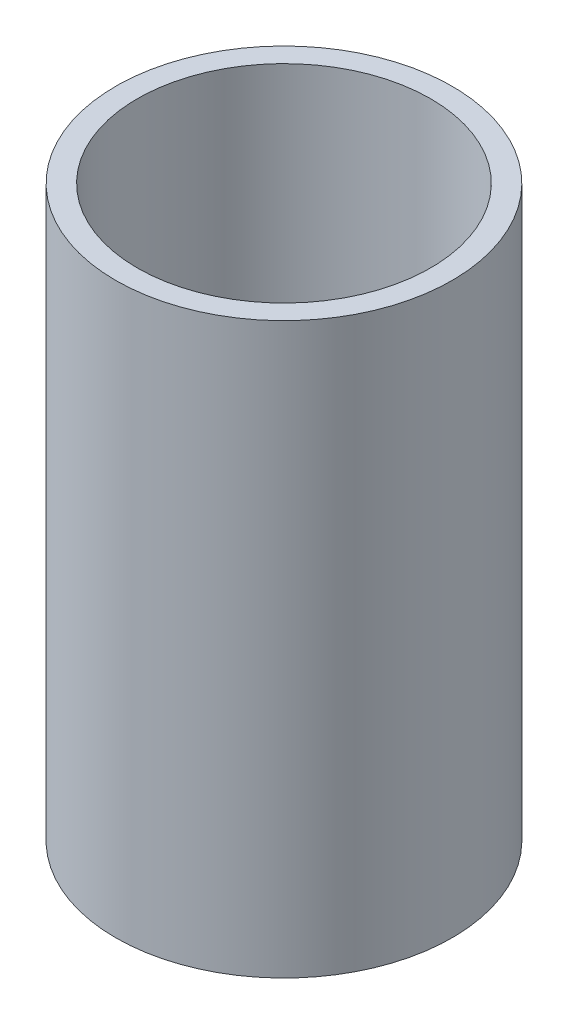
ISO-10303-21;
HEADER;
FILE_DESCRIPTION(('STEP AP214'),'2;1');
FILE_NAME('part.step','',(''),(''),'','','');
FILE_SCHEMA(('AUTOMOTIVE_DESIGN { 1 0 10303 214 1 1 1 1 }'));
ENDSEC;
DATA;
#1=APPLICATION_CONTEXT('core data for automotive mechanical design processes');
#2=APPLICATION_PROTOCOL_DEFINITION('international standard','automotive_design',2000,#1);
#3=PRODUCT_CONTEXT('',#1,'mechanical');
#4=PRODUCT('Part','Part','',(#3));
#5=PRODUCT_RELATED_PRODUCT_CATEGORY('part','',(#4));
#6=PRODUCT_DEFINITION_FORMATION('','',#4);
#7=PRODUCT_DEFINITION_CONTEXT('part definition',#1,'design');
#8=PRODUCT_DEFINITION('design','',#6,#7);
#9=PRODUCT_DEFINITION_SHAPE('','',#8);
#10=(LENGTH_UNIT() NAMED_UNIT(*) SI_UNIT(.MILLI.,.METRE.));
#11=(NAMED_UNIT(*) PLANE_ANGLE_UNIT() SI_UNIT($,.RADIAN.));
#12=(NAMED_UNIT(*) SI_UNIT($,.STERADIAN.) SOLID_ANGLE_UNIT());
#13=UNCERTAINTY_MEASURE_WITH_UNIT(LENGTH_MEASURE(1.E-05),#10,'distance_accuracy_value','');
#14=(GEOMETRIC_REPRESENTATION_CONTEXT(3) GLOBAL_UNCERTAINTY_ASSIGNED_CONTEXT((#13)) GLOBAL_UNIT_ASSIGNED_CONTEXT((#10,
#11,#12)) REPRESENTATION_CONTEXT('',''));
#15=CARTESIAN_POINT('',(0.,0.,0.));
#16=DIRECTION('',(0.,0.,1.));
#17=DIRECTION('',(1.,0.,0.));
#18=AXIS2_PLACEMENT_3D('',#15,#16,#17);
#19=CARTESIAN_POINT('',(0.,33.,0.));
#20=DIRECTION('',(0.,1.,0.));
#21=DIRECTION('',(0.,0.,1.));
#22=AXIS2_PLACEMENT_3D('',#19,#20,#21);
#23=PLANE('',#22);
#24=CARTESIAN_POINT('',(0.,33.,0.));
#25=DIRECTION('',(0.,1.,0.));
#26=DIRECTION('',(0.,0.,1.));
#27=AXIS2_PLACEMENT_3D('',#24,#25,#26);
#28=CIRCLE('',#27,9.75);
#29=CARTESIAN_POINT('',(0.,33.,9.75));
#30=VERTEX_POINT('',#29);
#31=EDGE_CURVE('E44',#30,#30,#28,.T.);
#32=ORIENTED_EDGE('',*,*,#31,.T.);
#33=EDGE_LOOP('',(#32));
#34=FACE_BOUND('',#33,.T.);
#35=CARTESIAN_POINT('',(0.,33.,0.));
#36=DIRECTION('',(0.,1.,0.));
#37=DIRECTION('',(0.,0.,1.));
#38=AXIS2_PLACEMENT_3D('',#35,#36,#37);
#39=CIRCLE('',#38,8.5);
#40=CARTESIAN_POINT('',(0.,33.,8.5));
#41=VERTEX_POINT('',#40);
#42=EDGE_CURVE('E53',#41,#41,#39,.T.);
#43=ORIENTED_EDGE('',*,*,#42,.F.);
#44=EDGE_LOOP('',(#43));
#45=FACE_BOUND('',#44,.T.);
#46=ADVANCED_FACE('F37',(#34,#45),#23,.T.);
#47=CARTESIAN_POINT('',(0.,0.,0.));
#48=DIRECTION('',(0.,1.,0.));
#49=DIRECTION('',(0.,0.,1.));
#50=AXIS2_PLACEMENT_3D('',#47,#48,#49);
#51=PLANE('',#50);
#52=CARTESIAN_POINT('',(0.,0.,0.));
#53=DIRECTION('',(0.,1.,0.));
#54=DIRECTION('',(0.,0.,1.));
#55=AXIS2_PLACEMENT_3D('',#52,#53,#54);
#56=CIRCLE('',#55,9.75);
#57=CARTESIAN_POINT('',(0.,0.,9.75));
#58=VERTEX_POINT('',#57);
#59=EDGE_CURVE('E48',#58,#58,#56,.T.);
#60=ORIENTED_EDGE('',*,*,#59,.F.);
#61=EDGE_LOOP('',(#60));
#62=FACE_BOUND('',#61,.T.);
#63=CARTESIAN_POINT('',(0.,0.,0.));
#64=DIRECTION('',(0.,1.,0.));
#65=DIRECTION('',(0.,0.,1.));
#66=AXIS2_PLACEMENT_3D('',#63,#64,#65);
#67=CIRCLE('',#66,5.);
#68=CARTESIAN_POINT('',(0.,0.,5.));
#69=VERTEX_POINT('',#68);
#70=EDGE_CURVE('E58',#69,#69,#67,.T.);
#71=ORIENTED_EDGE('',*,*,#70,.T.);
#72=EDGE_LOOP('',(#71));
#73=FACE_BOUND('',#72,.T.);
#74=ADVANCED_FACE('F79',(#62,#73),#51,.F.);
#75=CARTESIAN_POINT('',(0.,33.,0.));
#76=DIRECTION('',(0.,-1.,0.));
#77=DIRECTION('',(0.,0.,-1.));
#78=AXIS2_PLACEMENT_3D('',#75,#76,#77);
#79=CYLINDRICAL_SURFACE('',#78,9.75);
#80=ORIENTED_EDGE('',*,*,#31,.F.);
#81=EDGE_LOOP('',(#80));
#82=FACE_BOUND('',#81,.T.);
#83=ORIENTED_EDGE('',*,*,#59,.T.);
#84=EDGE_LOOP('',(#83));
#85=FACE_BOUND('',#84,.T.);
#86=ADVANCED_FACE('F39',(#82,#85),#79,.T.);
#87=CARTESIAN_POINT('',(0.,33.,0.));
#88=DIRECTION('',(0.,-1.,0.));
#89=DIRECTION('',(0.,0.,-1.));
#90=AXIS2_PLACEMENT_3D('',#87,#88,#89);
#91=CYLINDRICAL_SURFACE('',#90,8.5);
#92=CARTESIAN_POINT('',(0.,2.,0.));
#93=DIRECTION('',(0.,1.,0.));
#94=DIRECTION('',(0.,0.,1.));
#95=AXIS2_PLACEMENT_3D('',#92,#93,#94);
#96=CIRCLE('',#95,8.5);
#97=CARTESIAN_POINT('',(0.,2.,8.5));
#98=VERTEX_POINT('',#97);
#99=EDGE_CURVE('E10',#98,#98,#96,.T.);
#100=ORIENTED_EDGE('',*,*,#99,.F.);
#101=EDGE_LOOP('',(#100));
#102=FACE_BOUND('',#101,.T.);
#103=ORIENTED_EDGE('',*,*,#42,.T.);
#104=EDGE_LOOP('',(#103));
#105=FACE_BOUND('',#104,.T.);
#106=ADVANCED_FACE('F69',(#102,#105),#91,.F.);
#107=CARTESIAN_POINT('',(0.,2.,0.));
#108=DIRECTION('',(0.,1.,0.));
#109=DIRECTION('',(0.,0.,1.));
#110=AXIS2_PLACEMENT_3D('',#107,#108,#109);
#111=PLANE('',#110);
#112=ORIENTED_EDGE('',*,*,#99,.T.);
#113=EDGE_LOOP('',(#112));
#114=FACE_BOUND('',#113,.T.);
#115=CARTESIAN_POINT('',(0.,2.,0.));
#116=DIRECTION('',(0.,1.,0.));
#117=DIRECTION('',(0.,0.,1.));
#118=AXIS2_PLACEMENT_3D('',#115,#116,#117);
#119=CIRCLE('',#118,5.);
#120=CARTESIAN_POINT('',(0.,2.,5.));
#121=VERTEX_POINT('',#120);
#122=EDGE_CURVE('E57',#121,#121,#119,.T.);
#123=ORIENTED_EDGE('',*,*,#122,.F.);
#124=EDGE_LOOP('',(#123));
#125=FACE_BOUND('',#124,.T.);
#126=ADVANCED_FACE('F67',(#114,#125),#111,.T.);
#127=CARTESIAN_POINT('',(0.,2.,0.));
#128=DIRECTION('',(0.,-1.,0.));
#129=DIRECTION('',(0.,0.,-1.));
#130=AXIS2_PLACEMENT_3D('',#127,#128,#129);
#131=CYLINDRICAL_SURFACE('',#130,5.);
#132=ORIENTED_EDGE('',*,*,#122,.T.);
#133=EDGE_LOOP('',(#132));
#134=FACE_BOUND('',#133,.T.);
#135=ORIENTED_EDGE('',*,*,#70,.F.);
#136=EDGE_LOOP('',(#135));
#137=FACE_BOUND('',#136,.T.);
#138=ADVANCED_FACE('F64',(#134,#137),#131,.F.);
#139=CLOSED_SHELL('',(#46,#74,#86,#106,#126,#138));
#140=MANIFOLD_SOLID_BREP('B2',#139);
#141=ADVANCED_BREP_SHAPE_REPRESENTATION('',(#18,#140),#14);
#142=SHAPE_DEFINITION_REPRESENTATION(#9,#141);
ENDSEC;
END-ISO-10303-21;
